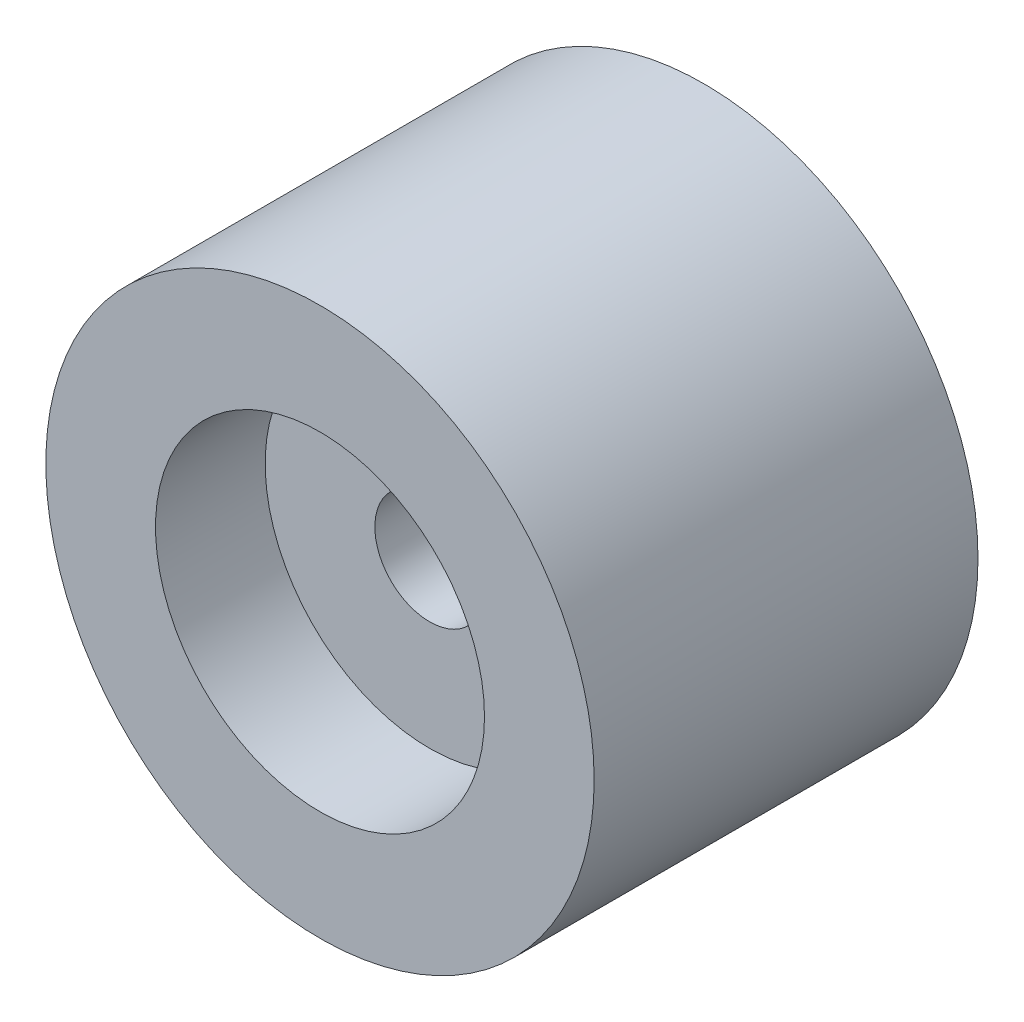
ISO-10303-21;
HEADER;
FILE_DESCRIPTION(('STEP AP214'),'2;1');
FILE_NAME('part.step','',(''),(''),'','','');
FILE_SCHEMA(('AUTOMOTIVE_DESIGN { 1 0 10303 214 1 1 1 1 }'));
ENDSEC;
DATA;
#1=APPLICATION_CONTEXT('core data for automotive mechanical design processes');
#2=APPLICATION_PROTOCOL_DEFINITION('international standard','automotive_design',2000,#1);
#3=PRODUCT_CONTEXT('',#1,'mechanical');
#4=PRODUCT('Part','Part','',(#3));
#5=PRODUCT_RELATED_PRODUCT_CATEGORY('part','',(#4));
#6=PRODUCT_DEFINITION_FORMATION('','',#4);
#7=PRODUCT_DEFINITION_CONTEXT('part definition',#1,'design');
#8=PRODUCT_DEFINITION('design','',#6,#7);
#9=PRODUCT_DEFINITION_SHAPE('','',#8);
#10=(LENGTH_UNIT() NAMED_UNIT(*) SI_UNIT(.MILLI.,.METRE.));
#11=(NAMED_UNIT(*) PLANE_ANGLE_UNIT() SI_UNIT($,.RADIAN.));
#12=(NAMED_UNIT(*) SI_UNIT($,.STERADIAN.) SOLID_ANGLE_UNIT());
#13=UNCERTAINTY_MEASURE_WITH_UNIT(LENGTH_MEASURE(1.E-05),#10,'distance_accuracy_value','');
#14=(GEOMETRIC_REPRESENTATION_CONTEXT(3) GLOBAL_UNCERTAINTY_ASSIGNED_CONTEXT((#13)) GLOBAL_UNIT_ASSIGNED_CONTEXT((#10,
#11,#12)) REPRESENTATION_CONTEXT('',''));
#15=CARTESIAN_POINT('',(0.,0.,0.));
#16=DIRECTION('',(0.,0.,1.));
#17=DIRECTION('',(1.,0.,0.));
#18=AXIS2_PLACEMENT_3D('',#15,#16,#17);
#19=CARTESIAN_POINT('',(0.,0.,140.));
#20=DIRECTION('',(0.,0.,-1.));
#21=DIRECTION('',(-1.,0.,0.));
#22=AXIS2_PLACEMENT_3D('',#19,#20,#21);
#23=CYLINDRICAL_SURFACE('',#22,100.);
#24=CARTESIAN_POINT('',(0.,0.,140.));
#25=DIRECTION('',(0.,0.,1.));
#26=DIRECTION('',(1.,0.,0.));
#27=AXIS2_PLACEMENT_3D('',#24,#25,#26);
#28=CIRCLE('',#27,100.);
#29=CARTESIAN_POINT('',(100.,0.,140.));
#30=VERTEX_POINT('',#29);
#31=EDGE_CURVE('E10',#30,#30,#28,.T.);
#32=ORIENTED_EDGE('',*,*,#31,.F.);
#33=EDGE_LOOP('',(#32));
#34=FACE_BOUND('',#33,.T.);
#35=CARTESIAN_POINT('',(0.,0.,0.));
#36=DIRECTION('',(0.,0.,1.));
#37=DIRECTION('',(1.,0.,0.));
#38=AXIS2_PLACEMENT_3D('',#35,#36,#37);
#39=CIRCLE('',#38,100.);
#40=CARTESIAN_POINT('',(100.,0.,0.));
#41=VERTEX_POINT('',#40);
#42=EDGE_CURVE('E34',#41,#41,#39,.T.);
#43=ORIENTED_EDGE('',*,*,#42,.T.);
#44=EDGE_LOOP('',(#43));
#45=FACE_BOUND('',#44,.T.);
#46=ADVANCED_FACE('F31',(#34,#45),#23,.T.);
#47=CARTESIAN_POINT('',(0.,0.,140.));
#48=DIRECTION('',(0.,0.,1.));
#49=DIRECTION('',(1.,0.,0.));
#50=AXIS2_PLACEMENT_3D('',#47,#48,#49);
#51=PLANE('',#50);
#52=CARTESIAN_POINT('',(0.,0.,140.));
#53=DIRECTION('',(0.,0.,1.));
#54=DIRECTION('',(1.,0.,0.));
#55=AXIS2_PLACEMENT_3D('',#52,#53,#54);
#56=CIRCLE('',#55,60.);
#57=CARTESIAN_POINT('',(60.,0.,140.));
#58=VERTEX_POINT('',#57);
#59=EDGE_CURVE('E43',#58,#58,#56,.T.);
#60=ORIENTED_EDGE('',*,*,#59,.F.);
#61=EDGE_LOOP('',(#60));
#62=FACE_BOUND('',#61,.T.);
#63=ORIENTED_EDGE('',*,*,#31,.T.);
#64=EDGE_LOOP('',(#63));
#65=FACE_BOUND('',#64,.T.);
#66=ADVANCED_FACE('F76',(#62,#65),#51,.T.);
#67=CARTESIAN_POINT('',(0.,0.,0.));
#68=DIRECTION('',(0.,0.,1.));
#69=DIRECTION('',(1.,0.,0.));
#70=AXIS2_PLACEMENT_3D('',#67,#68,#69);
#71=PLANE('',#70);
#72=ORIENTED_EDGE('',*,*,#42,.F.);
#73=EDGE_LOOP('',(#72));
#74=FACE_BOUND('',#73,.T.);
#75=ADVANCED_FACE('F72',(#74),#71,.F.);
#76=CARTESIAN_POINT('',(0.,0.,100.));
#77=DIRECTION('',(0.,0.,1.));
#78=DIRECTION('',(1.,0.,0.));
#79=AXIS2_PLACEMENT_3D('',#76,#77,#78);
#80=CYLINDRICAL_SURFACE('',#79,60.);
#81=CARTESIAN_POINT('',(0.,0.,100.));
#82=DIRECTION('',(0.,0.,1.));
#83=DIRECTION('',(1.,0.,0.));
#84=AXIS2_PLACEMENT_3D('',#81,#82,#83);
#85=CIRCLE('',#84,60.);
#86=CARTESIAN_POINT('',(60.,0.,100.));
#87=VERTEX_POINT('',#86);
#88=EDGE_CURVE('E41',#87,#87,#85,.T.);
#89=ORIENTED_EDGE('',*,*,#88,.F.);
#90=EDGE_LOOP('',(#89));
#91=FACE_BOUND('',#90,.T.);
#92=ORIENTED_EDGE('',*,*,#59,.T.);
#93=EDGE_LOOP('',(#92));
#94=FACE_BOUND('',#93,.T.);
#95=ADVANCED_FACE('F66',(#91,#94),#80,.F.);
#96=CARTESIAN_POINT('',(0.,0.,100.));
#97=DIRECTION('',(0.,0.,1.));
#98=DIRECTION('',(1.,0.,0.));
#99=AXIS2_PLACEMENT_3D('',#96,#97,#98);
#100=PLANE('',#99);
#101=CARTESIAN_POINT('',(0.,0.,100.));
#102=DIRECTION('',(0.,0.,1.));
#103=DIRECTION('',(1.,0.,0.));
#104=AXIS2_PLACEMENT_3D('',#101,#102,#103);
#105=CIRCLE('',#104,20.);
#106=CARTESIAN_POINT('',(20.,0.,100.));
#107=VERTEX_POINT('',#106);
#108=EDGE_CURVE('E49',#107,#107,#105,.T.);
#109=ORIENTED_EDGE('',*,*,#108,.F.);
#110=EDGE_LOOP('',(#109));
#111=FACE_BOUND('',#110,.T.);
#112=ORIENTED_EDGE('',*,*,#88,.T.);
#113=EDGE_LOOP('',(#112));
#114=FACE_BOUND('',#113,.T.);
#115=ADVANCED_FACE('F60',(#111,#114),#100,.T.);
#116=CARTESIAN_POINT('',(0.,0.,20.));
#117=DIRECTION('',(0.,0.,1.));
#118=DIRECTION('',(1.,0.,0.));
#119=AXIS2_PLACEMENT_3D('',#116,#117,#118);
#120=CYLINDRICAL_SURFACE('',#119,20.);
#121=CARTESIAN_POINT('',(0.,0.,20.));
#122=DIRECTION('',(0.,0.,1.));
#123=DIRECTION('',(1.,0.,0.));
#124=AXIS2_PLACEMENT_3D('',#121,#122,#123);
#125=CIRCLE('',#124,20.);
#126=CARTESIAN_POINT('',(20.,0.,20.));
#127=VERTEX_POINT('',#126);
#128=EDGE_CURVE('E46',#127,#127,#125,.T.);
#129=ORIENTED_EDGE('',*,*,#128,.F.);
#130=EDGE_LOOP('',(#129));
#131=FACE_BOUND('',#130,.T.);
#132=ORIENTED_EDGE('',*,*,#108,.T.);
#133=EDGE_LOOP('',(#132));
#134=FACE_BOUND('',#133,.T.);
#135=ADVANCED_FACE('F57',(#131,#134),#120,.F.);
#136=CARTESIAN_POINT('',(0.,0.,20.));
#137=DIRECTION('',(0.,0.,1.));
#138=DIRECTION('',(1.,0.,0.));
#139=AXIS2_PLACEMENT_3D('',#136,#137,#138);
#140=PLANE('',#139);
#141=ORIENTED_EDGE('',*,*,#128,.T.);
#142=EDGE_LOOP('',(#141));
#143=FACE_BOUND('',#142,.T.);
#144=ADVANCED_FACE('F55',(#143),#140,.T.);
#145=CLOSED_SHELL('',(#46,#66,#75,#95,#115,#135,#144));
#146=MANIFOLD_SOLID_BREP('B2',#145);
#147=ADVANCED_BREP_SHAPE_REPRESENTATION('',(#18,#146),#14);
#148=SHAPE_DEFINITION_REPRESENTATION(#9,#147);
ENDSEC;
END-ISO-10303-21;
